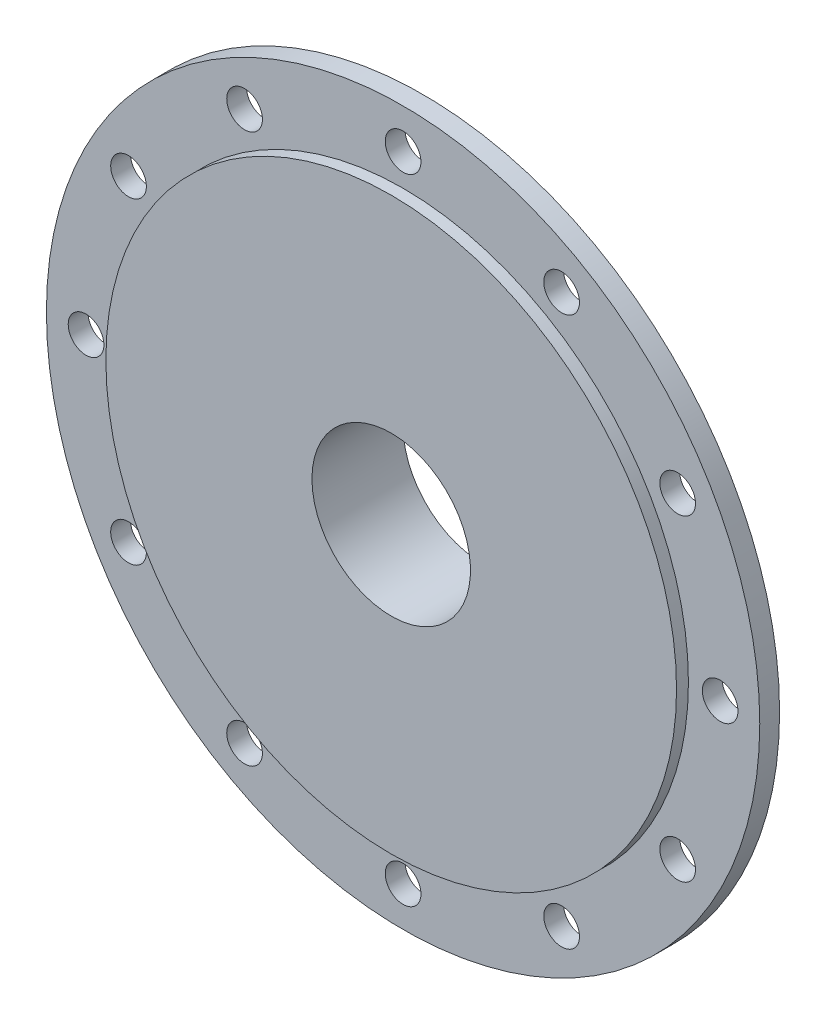
ISO-10303-21;
HEADER;
FILE_DESCRIPTION(('STEP AP214'),'2;1');
FILE_NAME('part.step','',(''),(''),'','','');
FILE_SCHEMA(('AUTOMOTIVE_DESIGN { 1 0 10303 214 1 1 1 1 }'));
ENDSEC;
DATA;
#1=APPLICATION_CONTEXT('core data for automotive mechanical design processes');
#2=APPLICATION_PROTOCOL_DEFINITION('international standard','automotive_design',2000,#1);
#3=PRODUCT_CONTEXT('',#1,'mechanical');
#4=PRODUCT('Part','Part','',(#3));
#5=PRODUCT_RELATED_PRODUCT_CATEGORY('part','',(#4));
#6=PRODUCT_DEFINITION_FORMATION('','',#4);
#7=PRODUCT_DEFINITION_CONTEXT('part definition',#1,'design');
#8=PRODUCT_DEFINITION('design','',#6,#7);
#9=PRODUCT_DEFINITION_SHAPE('','',#8);
#10=(LENGTH_UNIT() NAMED_UNIT(*) SI_UNIT(.MILLI.,.METRE.));
#11=(NAMED_UNIT(*) PLANE_ANGLE_UNIT() SI_UNIT($,.RADIAN.));
#12=(NAMED_UNIT(*) SI_UNIT($,.STERADIAN.) SOLID_ANGLE_UNIT());
#13=UNCERTAINTY_MEASURE_WITH_UNIT(LENGTH_MEASURE(1.E-05),#10,'distance_accuracy_value','');
#14=(GEOMETRIC_REPRESENTATION_CONTEXT(3) GLOBAL_UNCERTAINTY_ASSIGNED_CONTEXT((#13)) GLOBAL_UNIT_ASSIGNED_CONTEXT((#10,
#11,#12)) REPRESENTATION_CONTEXT('',''));
#15=CARTESIAN_POINT('',(0.,0.,0.));
#16=DIRECTION('',(0.,0.,1.));
#17=DIRECTION('',(1.,0.,0.));
#18=AXIS2_PLACEMENT_3D('',#15,#16,#17);
#19=CARTESIAN_POINT('',(0.,0.,0.));
#20=DIRECTION('',(0.,0.,-1.));
#21=DIRECTION('',(-1.,0.,0.));
#22=AXIS2_PLACEMENT_3D('',#19,#20,#21);
#23=CYLINDRICAL_SURFACE('',#22,67.5);
#24=CARTESIAN_POINT('',(0.,0.,-5.00000000000001));
#25=DIRECTION('',(0.,0.,-1.));
#26=DIRECTION('',(-1.,0.,0.));
#27=AXIS2_PLACEMENT_3D('',#24,#25,#26);
#28=CIRCLE('',#27,67.5);
#29=CARTESIAN_POINT('',(67.4536878161602,-2.5,-5.00000000000001));
#30=VERTEX_POINT('',#29);
#31=CARTESIAN_POINT('',(2.5,-67.4536878161602,-5.00000000000001));
#32=VERTEX_POINT('',#31);
#33=EDGE_CURVE('E368',#30,#32,#28,.T.);
#34=ORIENTED_EDGE('',*,*,#33,.F.);
#35=DIRECTION('',(0.,0.,-1.));
#36=VECTOR('',#35,1.);
#37=CARTESIAN_POINT('',(67.4536878161602,-2.5,0.));
#38=LINE('',#37,#36);
#39=CARTESIAN_POINT('',(67.4536878161602,-2.5,-8.00000000000001));
#40=VERTEX_POINT('',#39);
#41=EDGE_CURVE('E456',#30,#40,#38,.T.);
#42=ORIENTED_EDGE('',*,*,#41,.T.);
#43=CARTESIAN_POINT('',(0.,0.,-8.00000000000001));
#44=DIRECTION('',(0.,0.,-1.));
#45=DIRECTION('',(-1.,0.,0.));
#46=AXIS2_PLACEMENT_3D('',#43,#44,#45);
#47=CIRCLE('',#46,67.5);
#48=CARTESIAN_POINT('',(2.5,-67.4536878161602,-8.00000000000001));
#49=VERTEX_POINT('',#48);
#50=EDGE_CURVE('E375',#40,#49,#47,.T.);
#51=ORIENTED_EDGE('',*,*,#50,.T.);
#52=DIRECTION('',(0.,0.,-1.));
#53=VECTOR('',#52,1.);
#54=CARTESIAN_POINT('',(2.5,-67.4536878161602,0.));
#55=LINE('',#54,#53);
#56=EDGE_CURVE('E285',#32,#49,#55,.T.);
#57=ORIENTED_EDGE('',*,*,#56,.F.);
#58=EDGE_LOOP('',(#34,#42,#51,#57));
#59=FACE_BOUND('',#58,.T.);
#60=ADVANCED_FACE('F43',(#59),#23,.F.);
#61=CARTESIAN_POINT('',(0.,67.5,-5.00000000000001));
#62=DIRECTION('',(0.,0.,-1.));
#63=DIRECTION('',(-1.,0.,0.));
#64=AXIS2_PLACEMENT_3D('',#61,#62,#63);
#65=PLANE('',#64);
#66=CARTESIAN_POINT('',(0.,0.,-5.00000000000001));
#67=DIRECTION('',(0.,0.,-1.));
#68=DIRECTION('',(-1.,0.,0.));
#69=AXIS2_PLACEMENT_3D('',#66,#67,#68);
#70=CIRCLE('',#69,25.);
#71=CARTESIAN_POINT('',(24.8746859276655,-2.5,-5.00000000000001));
#72=VERTEX_POINT('',#71);
#73=CARTESIAN_POINT('',(2.5,-24.8746859276655,-5.00000000000001));
#74=VERTEX_POINT('',#73);
#75=EDGE_CURVE('E361',#72,#74,#70,.T.);
#76=ORIENTED_EDGE('',*,*,#75,.F.);
#77=DIRECTION('',(1.,0.,0.));
#78=VECTOR('',#77,1.);
#79=CARTESIAN_POINT('',(0.,-2.5,-5.00000000000001));
#80=LINE('',#79,#78);
#81=EDGE_CURVE('E59',#72,#30,#80,.T.);
#82=ORIENTED_EDGE('',*,*,#81,.T.);
#83=ORIENTED_EDGE('',*,*,#33,.T.);
#84=DIRECTION('',(0.,-1.,0.));
#85=VECTOR('',#84,1.);
#86=CARTESIAN_POINT('',(2.5,67.5,-5.00000000000001));
#87=LINE('',#86,#85);
#88=EDGE_CURVE('E289',#74,#32,#87,.T.);
#89=ORIENTED_EDGE('',*,*,#88,.F.);
#90=EDGE_LOOP('',(#76,#82,#83,#89));
#91=FACE_BOUND('',#90,.T.);
#92=ADVANCED_FACE('F403',(#91),#65,.T.);
#93=CARTESIAN_POINT('',(-2.5,-67.4536878161602,-8.00000000000001));
#94=VERTEX_POINT('',#93);
#95=CARTESIAN_POINT('',(-67.4536878161602,-2.5,-8.00000000000001));
#96=VERTEX_POINT('',#95);
#97=EDGE_CURVE('E376',#94,#96,#47,.T.);
#98=ORIENTED_EDGE('',*,*,#97,.T.);
#99=DIRECTION('',(0.,0.,-1.));
#100=VECTOR('',#99,1.);
#101=CARTESIAN_POINT('',(-67.4536878161602,-2.5,0.));
#102=LINE('',#101,#100);
#103=CARTESIAN_POINT('',(-67.4536878161602,-2.5,-5.00000000000001));
#104=VERTEX_POINT('',#103);
#105=EDGE_CURVE('E228',#96,#104,#102,.F.);
#106=ORIENTED_EDGE('',*,*,#105,.T.);
#107=CARTESIAN_POINT('',(-2.5,-67.4536878161602,-5.00000000000001));
#108=VERTEX_POINT('',#107);
#109=EDGE_CURVE('E369',#108,#104,#28,.T.);
#110=ORIENTED_EDGE('',*,*,#109,.F.);
#111=DIRECTION('',(0.,0.,-1.));
#112=VECTOR('',#111,1.);
#113=CARTESIAN_POINT('',(-2.5,-67.4536878161602,0.));
#114=LINE('',#113,#112);
#115=EDGE_CURVE('E270',#108,#94,#114,.T.);
#116=ORIENTED_EDGE('',*,*,#115,.T.);
#117=EDGE_LOOP('',(#98,#106,#110,#116));
#118=FACE_BOUND('',#117,.T.);
#119=ADVANCED_FACE('F406',(#118),#23,.F.);
#120=ORIENTED_EDGE('',*,*,#109,.T.);
#121=DIRECTION('',(1.,0.,0.));
#122=VECTOR('',#121,1.);
#123=CARTESIAN_POINT('',(0.,-2.5,-5.00000000000001));
#124=LINE('',#123,#122);
#125=CARTESIAN_POINT('',(-24.8746859276655,-2.5,-5.00000000000001));
#126=VERTEX_POINT('',#125);
#127=EDGE_CURVE('E232',#104,#126,#124,.T.);
#128=ORIENTED_EDGE('',*,*,#127,.T.);
#129=CARTESIAN_POINT('',(-2.5,-24.8746859276655,-5.00000000000001));
#130=VERTEX_POINT('',#129);
#131=EDGE_CURVE('E362',#130,#126,#70,.T.);
#132=ORIENTED_EDGE('',*,*,#131,.F.);
#133=DIRECTION('',(0.,-1.,0.));
#134=VECTOR('',#133,1.);
#135=CARTESIAN_POINT('',(-2.5,67.5,-5.00000000000001));
#136=LINE('',#135,#134);
#137=EDGE_CURVE('E274',#130,#108,#136,.T.);
#138=ORIENTED_EDGE('',*,*,#137,.T.);
#139=EDGE_LOOP('',(#120,#128,#132,#138));
#140=FACE_BOUND('',#139,.T.);
#141=ADVANCED_FACE('F413',(#140),#65,.T.);
#142=DIRECTION('',(0.,0.,-1.));
#143=VECTOR('',#142,1.);
#144=CARTESIAN_POINT('',(-67.4536878161602,2.5,0.));
#145=LINE('',#144,#143);
#146=CARTESIAN_POINT('',(-67.4536878161602,2.5,-8.00000000000001));
#147=VERTEX_POINT('',#146);
#148=CARTESIAN_POINT('',(-67.4536878161602,2.5,-5.00000000000001));
#149=VERTEX_POINT('',#148);
#150=EDGE_CURVE('E243',#147,#149,#145,.F.);
#151=ORIENTED_EDGE('',*,*,#150,.F.);
#152=CARTESIAN_POINT('',(-2.5,67.4536878161602,-8.00000000000001));
#153=VERTEX_POINT('',#152);
#154=EDGE_CURVE('E367',#147,#153,#47,.T.);
#155=ORIENTED_EDGE('',*,*,#154,.T.);
#156=DIRECTION('',(0.,0.,-1.));
#157=VECTOR('',#156,1.);
#158=CARTESIAN_POINT('',(-2.5,67.4536878161602,0.));
#159=LINE('',#158,#157);
#160=CARTESIAN_POINT('',(-2.5,67.4536878161602,-5.00000000000001));
#161=VERTEX_POINT('',#160);
#162=EDGE_CURVE('E314',#153,#161,#159,.F.);
#163=ORIENTED_EDGE('',*,*,#162,.T.);
#164=EDGE_CURVE('E360',#149,#161,#28,.T.);
#165=ORIENTED_EDGE('',*,*,#164,.F.);
#166=EDGE_LOOP('',(#151,#155,#163,#165));
#167=FACE_BOUND('',#166,.T.);
#168=ADVANCED_FACE('F419',(#167),#23,.F.);
#169=DIRECTION('',(1.,0.,0.));
#170=VECTOR('',#169,1.);
#171=CARTESIAN_POINT('',(0.,2.5,-5.00000000000001));
#172=LINE('',#171,#170);
#173=CARTESIAN_POINT('',(-24.8746859276655,2.5,-5.00000000000001));
#174=VERTEX_POINT('',#173);
#175=EDGE_CURVE('E246',#149,#174,#172,.T.);
#176=ORIENTED_EDGE('',*,*,#175,.F.);
#177=ORIENTED_EDGE('',*,*,#164,.T.);
#178=DIRECTION('',(0.,-1.,0.));
#179=VECTOR('',#178,1.);
#180=CARTESIAN_POINT('',(-2.5,67.5,-5.00000000000001));
#181=LINE('',#180,#179);
#182=CARTESIAN_POINT('',(-2.5,24.8746859276655,-5.00000000000001));
#183=VERTEX_POINT('',#182);
#184=EDGE_CURVE('E310',#161,#183,#181,.T.);
#185=ORIENTED_EDGE('',*,*,#184,.T.);
#186=EDGE_CURVE('E356',#174,#183,#70,.T.);
#187=ORIENTED_EDGE('',*,*,#186,.F.);
#188=EDGE_LOOP('',(#176,#177,#185,#187));
#189=FACE_BOUND('',#188,.T.);
#190=ADVANCED_FACE('F400',(#189),#65,.T.);
#191=CARTESIAN_POINT('',(0.,20.,0.));
#192=DIRECTION('',(0.,0.,1.));
#193=DIRECTION('',(1.,0.,0.));
#194=AXIS2_PLACEMENT_3D('',#191,#192,#193);
#195=PLANE('',#194);
#196=CARTESIAN_POINT('',(0.,0.,0.));
#197=DIRECTION('',(0.,0.,-1.));
#198=DIRECTION('',(-1.,0.,0.));
#199=AXIS2_PLACEMENT_3D('',#196,#197,#198);
#200=CIRCLE('',#199,20.);
#201=CARTESIAN_POINT('',(-20.,0.,0.));
#202=VERTEX_POINT('',#201);
#203=EDGE_CURVE('E345',#202,#202,#200,.T.);
#204=ORIENTED_EDGE('',*,*,#203,.T.);
#205=EDGE_LOOP('',(#204));
#206=FACE_BOUND('',#205,.T.);
#207=CARTESIAN_POINT('',(0.,0.,0.));
#208=DIRECTION('',(0.,0.,-1.));
#209=DIRECTION('',(-1.,0.,0.));
#210=AXIS2_PLACEMENT_3D('',#207,#208,#209);
#211=CIRCLE('',#210,72.);
#212=CARTESIAN_POINT('',(-72.,0.,0.));
#213=VERTEX_POINT('',#212);
#214=EDGE_CURVE('E11',#213,#213,#211,.T.);
#215=ORIENTED_EDGE('',*,*,#214,.F.);
#216=EDGE_LOOP('',(#215));
#217=FACE_BOUND('',#216,.T.);
#218=ADVANCED_FACE('F45',(#206,#217),#195,.T.);
#219=CARTESIAN_POINT('',(0.,0.,0.));
#220=DIRECTION('',(0.,0.,-1.));
#221=DIRECTION('',(-1.,0.,0.));
#222=AXIS2_PLACEMENT_3D('',#219,#220,#221);
#223=CYLINDRICAL_SURFACE('',#222,72.);
#224=ORIENTED_EDGE('',*,*,#214,.T.);
#225=EDGE_LOOP('',(#224));
#226=FACE_BOUND('',#225,.T.);
#227=CARTESIAN_POINT('',(0.,0.,-3.));
#228=DIRECTION('',(0.,0.,-1.));
#229=DIRECTION('',(-1.,0.,0.));
#230=AXIS2_PLACEMENT_3D('',#227,#228,#229);
#231=CIRCLE('',#230,72.);
#232=CARTESIAN_POINT('',(-72.,0.,-3.));
#233=VERTEX_POINT('',#232);
#234=EDGE_CURVE('E52',#233,#233,#231,.T.);
#235=ORIENTED_EDGE('',*,*,#234,.F.);
#236=EDGE_LOOP('',(#235));
#237=FACE_BOUND('',#236,.T.);
#238=ADVANCED_FACE('F390',(#226,#237),#223,.T.);
#239=CARTESIAN_POINT('',(0.,72.,-3.));
#240=DIRECTION('',(0.,0.,1.));
#241=DIRECTION('',(1.,0.,0.));
#242=AXIS2_PLACEMENT_3D('',#239,#240,#241);
#243=PLANE('',#242);
#244=CARTESIAN_POINT('',(0.,80.,-3.));
#245=DIRECTION('',(0.,0.,1.));
#246=DIRECTION('',(1.,0.,0.));
#247=AXIS2_PLACEMENT_3D('',#244,#245,#246);
#248=CIRCLE('',#247,4.5);
#249=CARTESIAN_POINT('',(4.5,80.,-3.));
#250=VERTEX_POINT('',#249);
#251=EDGE_CURVE('E929',#250,#250,#248,.F.);
#252=ORIENTED_EDGE('',*,*,#251,.T.);
#253=EDGE_LOOP('',(#252));
#254=FACE_BOUND('',#253,.T.);
#255=CARTESIAN_POINT('',(39.9999999999996,69.2820323027534,-3.));
#256=DIRECTION('',(0.,0.,1.));
#257=DIRECTION('',(1.,0.,0.));
#258=AXIS2_PLACEMENT_3D('',#255,#256,#257);
#259=CIRCLE('',#258,4.50000000000195);
#260=CARTESIAN_POINT('',(44.5000000000015,69.2820323027534,-3.));
#261=VERTEX_POINT('',#260);
#262=EDGE_CURVE('E955',#261,#261,#259,.F.);
#263=ORIENTED_EDGE('',*,*,#262,.T.);
#264=EDGE_LOOP('',(#263));
#265=FACE_BOUND('',#264,.T.);
#266=CARTESIAN_POINT('',(69.2820323027551,39.9999999999999,-3.));
#267=DIRECTION('',(0.,0.,1.));
#268=DIRECTION('',(1.,0.,0.));
#269=AXIS2_PLACEMENT_3D('',#266,#267,#268);
#270=CIRCLE('',#269,4.50000000000096);
#271=CARTESIAN_POINT('',(73.7820323027561,39.9999999999999,-3.));
#272=VERTEX_POINT('',#271);
#273=EDGE_CURVE('E947',#272,#272,#270,.F.);
#274=ORIENTED_EDGE('',*,*,#273,.T.);
#275=EDGE_LOOP('',(#274));
#276=FACE_BOUND('',#275,.T.);
#277=CARTESIAN_POINT('',(80.,0.,-3.));
#278=DIRECTION('',(0.,0.,1.));
#279=DIRECTION('',(1.,0.,0.));
#280=AXIS2_PLACEMENT_3D('',#277,#278,#279);
#281=CIRCLE('',#280,4.50000000000081);
#282=CARTESIAN_POINT('',(84.5000000000008,0.,-3.));
#283=VERTEX_POINT('',#282);
#284=EDGE_CURVE('E938',#283,#283,#281,.F.);
#285=ORIENTED_EDGE('',*,*,#284,.T.);
#286=EDGE_LOOP('',(#285));
#287=FACE_BOUND('',#286,.T.);
#288=CARTESIAN_POINT('',(-40.0000000000001,69.2820323027551,-3.));
#289=DIRECTION('',(0.,0.,1.));
#290=DIRECTION('',(1.,0.,0.));
#291=AXIS2_PLACEMENT_3D('',#288,#289,#290);
#292=CIRCLE('',#291,4.5);
#293=CARTESIAN_POINT('',(-35.5000000000001,69.2820323027551,-3.));
#294=VERTEX_POINT('',#293);
#295=EDGE_CURVE('E935',#294,#294,#292,.F.);
#296=ORIENTED_EDGE('',*,*,#295,.T.);
#297=EDGE_LOOP('',(#296));
#298=FACE_BOUND('',#297,.T.);
#299=CARTESIAN_POINT('',(-69.2820323027551,40.,-3.));
#300=DIRECTION('',(0.,0.,1.));
#301=DIRECTION('',(1.,0.,0.));
#302=AXIS2_PLACEMENT_3D('',#299,#300,#301);
#303=CIRCLE('',#302,4.50000000000018);
#304=CARTESIAN_POINT('',(-64.7820323027549,40.,-3.));
#305=VERTEX_POINT('',#304);
#306=EDGE_CURVE('E1002',#305,#305,#303,.F.);
#307=ORIENTED_EDGE('',*,*,#306,.T.);
#308=EDGE_LOOP('',(#307));
#309=FACE_BOUND('',#308,.T.);
#310=CARTESIAN_POINT('',(-80.,0.,-3.));
#311=DIRECTION('',(0.,0.,1.));
#312=DIRECTION('',(1.,0.,0.));
#313=AXIS2_PLACEMENT_3D('',#310,#311,#312);
#314=CIRCLE('',#313,4.50000000000027);
#315=CARTESIAN_POINT('',(-75.4999999999997,0.,-3.));
#316=VERTEX_POINT('',#315);
#317=EDGE_CURVE('E1010',#316,#316,#314,.F.);
#318=ORIENTED_EDGE('',*,*,#317,.T.);
#319=EDGE_LOOP('',(#318));
#320=FACE_BOUND('',#319,.T.);
#321=CARTESIAN_POINT('',(-69.2820323027551,-40.,-3.));
#322=DIRECTION('',(0.,0.,1.));
#323=DIRECTION('',(1.,0.,0.));
#324=AXIS2_PLACEMENT_3D('',#321,#322,#323);
#325=CIRCLE('',#324,4.50000000000037);
#326=CARTESIAN_POINT('',(-64.7820323027547,-40.,-3.));
#327=VERTEX_POINT('',#326);
#328=EDGE_CURVE('E1018',#327,#327,#325,.F.);
#329=ORIENTED_EDGE('',*,*,#328,.T.);
#330=EDGE_LOOP('',(#329));
#331=FACE_BOUND('',#330,.T.);
#332=CARTESIAN_POINT('',(-40.,-69.2820323027551,-3.));
#333=DIRECTION('',(0.,0.,1.));
#334=DIRECTION('',(1.,0.,0.));
#335=AXIS2_PLACEMENT_3D('',#332,#333,#334);
#336=CIRCLE('',#335,4.50000000000049);
#337=CARTESIAN_POINT('',(-35.4999999999995,-69.2820323027551,-3.));
#338=VERTEX_POINT('',#337);
#339=EDGE_CURVE('E963',#338,#338,#336,.F.);
#340=ORIENTED_EDGE('',*,*,#339,.T.);
#341=EDGE_LOOP('',(#340));
#342=FACE_BOUND('',#341,.T.);
#343=CARTESIAN_POINT('',(0.,-80.,-3.));
#344=DIRECTION('',(0.,0.,1.));
#345=DIRECTION('',(1.,0.,0.));
#346=AXIS2_PLACEMENT_3D('',#343,#344,#345);
#347=CIRCLE('',#346,4.50000000000054);
#348=CARTESIAN_POINT('',(4.50000000000054,-80.,-3.));
#349=VERTEX_POINT('',#348);
#350=EDGE_CURVE('E972',#349,#349,#347,.F.);
#351=ORIENTED_EDGE('',*,*,#350,.T.);
#352=EDGE_LOOP('',(#351));
#353=FACE_BOUND('',#352,.T.);
#354=CARTESIAN_POINT('',(40.,-69.2820323027551,-3.));
#355=DIRECTION('',(0.,0.,1.));
#356=DIRECTION('',(1.,0.,0.));
#357=AXIS2_PLACEMENT_3D('',#354,#355,#356);
#358=CIRCLE('',#357,4.50000000000065);
#359=CARTESIAN_POINT('',(44.5000000000006,-69.2820323027551,-3.));
#360=VERTEX_POINT('',#359);
#361=EDGE_CURVE('E980',#360,#360,#358,.F.);
#362=ORIENTED_EDGE('',*,*,#361,.T.);
#363=EDGE_LOOP('',(#362));
#364=FACE_BOUND('',#363,.T.);
#365=CARTESIAN_POINT('',(69.2820323027551,-40.,-3.));
#366=DIRECTION('',(0.,0.,1.));
#367=DIRECTION('',(1.,0.,0.));
#368=AXIS2_PLACEMENT_3D('',#365,#366,#367);
#369=CIRCLE('',#368,4.50000000000072);
#370=CARTESIAN_POINT('',(73.7820323027558,-40.,-3.));
#371=VERTEX_POINT('',#370);
#372=EDGE_CURVE('E988',#371,#371,#369,.F.);
#373=ORIENTED_EDGE('',*,*,#372,.T.);
#374=EDGE_LOOP('',(#373));
#375=FACE_BOUND('',#374,.T.);
#376=ORIENTED_EDGE('',*,*,#234,.T.);
#377=EDGE_LOOP('',(#376));
#378=FACE_BOUND('',#377,.T.);
#379=CARTESIAN_POINT('',(0.,0.,-3.));
#380=DIRECTION('',(0.,0.,-1.));
#381=DIRECTION('',(-1.,0.,0.));
#382=AXIS2_PLACEMENT_3D('',#379,#380,#381);
#383=CIRCLE('',#382,90.);
#384=CARTESIAN_POINT('',(-90.,0.,-3.));
#385=VERTEX_POINT('',#384);
#386=EDGE_CURVE('E380',#385,#385,#383,.T.);
#387=ORIENTED_EDGE('',*,*,#386,.F.);
#388=EDGE_LOOP('',(#387));
#389=FACE_BOUND('',#388,.T.);
#390=ADVANCED_FACE('F387',(#254,#265,#276,#287,#298,#309,#320,#331,#342,#353,#364,#375,#378,
#389),#243,.T.);
#391=CARTESIAN_POINT('',(0.,0.,0.));
#392=DIRECTION('',(0.,0.,-1.));
#393=DIRECTION('',(-1.,0.,0.));
#394=AXIS2_PLACEMENT_3D('',#391,#392,#393);
#395=CYLINDRICAL_SURFACE('',#394,90.);
#396=CARTESIAN_POINT('',(0.,0.,-8.));
#397=DIRECTION('',(0.,0.,-1.));
#398=DIRECTION('',(-1.,0.,0.));
#399=AXIS2_PLACEMENT_3D('',#396,#397,#398);
#400=CIRCLE('',#399,90.);
#401=CARTESIAN_POINT('',(-90.,0.,-8.));
#402=VERTEX_POINT('',#401);
#403=EDGE_CURVE('E374',#402,#402,#400,.T.);
#404=ORIENTED_EDGE('',*,*,#403,.F.);
#405=EDGE_LOOP('',(#404));
#406=FACE_BOUND('',#405,.T.);
#407=ORIENTED_EDGE('',*,*,#386,.T.);
#408=EDGE_LOOP('',(#407));
#409=FACE_BOUND('',#408,.T.);
#410=ADVANCED_FACE('F397',(#406,#409),#395,.T.);
#411=CARTESIAN_POINT('',(0.,90.,-8.));
#412=DIRECTION('',(0.,0.,-1.));
#413=DIRECTION('',(-1.,0.,0.));
#414=AXIS2_PLACEMENT_3D('',#411,#412,#413);
#415=PLANE('',#414);
#416=CARTESIAN_POINT('',(0.,80.,-8.));
#417=DIRECTION('',(0.,0.,-1.));
#418=DIRECTION('',(-1.,0.,0.));
#419=AXIS2_PLACEMENT_3D('',#416,#417,#418);
#420=CIRCLE('',#419,4.5);
#421=CARTESIAN_POINT('',(-4.5,80.,-8.));
#422=VERTEX_POINT('',#421);
#423=EDGE_CURVE('E198',#422,#422,#420,.T.);
#424=ORIENTED_EDGE('',*,*,#423,.F.);
#425=EDGE_LOOP('',(#424));
#426=FACE_BOUND('',#425,.T.);
#427=CARTESIAN_POINT('',(39.9999999999996,69.2820323027534,-8.));
#428=DIRECTION('',(0.,0.,-1.));
#429=DIRECTION('',(-1.,0.,0.));
#430=AXIS2_PLACEMENT_3D('',#427,#428,#429);
#431=CIRCLE('',#430,4.50000000000195);
#432=CARTESIAN_POINT('',(35.4999999999976,69.2820323027534,-8.));
#433=VERTEX_POINT('',#432);
#434=EDGE_CURVE('E959',#433,#433,#431,.T.);
#435=ORIENTED_EDGE('',*,*,#434,.F.);
#436=EDGE_LOOP('',(#435));
#437=FACE_BOUND('',#436,.T.);
#438=CARTESIAN_POINT('',(69.2820323027551,39.9999999999999,-8.));
#439=DIRECTION('',(0.,0.,-1.));
#440=DIRECTION('',(-1.,0.,0.));
#441=AXIS2_PLACEMENT_3D('',#438,#439,#440);
#442=CIRCLE('',#441,4.50000000000096);
#443=CARTESIAN_POINT('',(64.7820323027542,39.9999999999999,-8.));
#444=VERTEX_POINT('',#443);
#445=EDGE_CURVE('E951',#444,#444,#442,.T.);
#446=ORIENTED_EDGE('',*,*,#445,.F.);
#447=EDGE_LOOP('',(#446));
#448=FACE_BOUND('',#447,.T.);
#449=CARTESIAN_POINT('',(80.,0.,-8.));
#450=DIRECTION('',(0.,0.,-1.));
#451=DIRECTION('',(-1.,0.,0.));
#452=AXIS2_PLACEMENT_3D('',#449,#450,#451);
#453=CIRCLE('',#452,4.50000000000081);
#454=CARTESIAN_POINT('',(75.4999999999992,0.,-8.));
#455=VERTEX_POINT('',#454);
#456=EDGE_CURVE('E943',#455,#455,#453,.T.);
#457=ORIENTED_EDGE('',*,*,#456,.F.);
#458=EDGE_LOOP('',(#457));
#459=FACE_BOUND('',#458,.T.);
#460=CARTESIAN_POINT('',(-40.0000000000001,69.2820323027551,-8.));
#461=DIRECTION('',(0.,0.,-1.));
#462=DIRECTION('',(-1.,0.,0.));
#463=AXIS2_PLACEMENT_3D('',#460,#461,#462);
#464=CIRCLE('',#463,4.5);
#465=CARTESIAN_POINT('',(-44.5000000000001,69.2820323027551,-8.));
#466=VERTEX_POINT('',#465);
#467=EDGE_CURVE('E998',#466,#466,#464,.T.);
#468=ORIENTED_EDGE('',*,*,#467,.F.);
#469=EDGE_LOOP('',(#468));
#470=FACE_BOUND('',#469,.T.);
#471=CARTESIAN_POINT('',(-69.2820323027551,40.,-8.));
#472=DIRECTION('',(0.,0.,-1.));
#473=DIRECTION('',(-1.,0.,0.));
#474=AXIS2_PLACEMENT_3D('',#471,#472,#473);
#475=CIRCLE('',#474,4.50000000000018);
#476=CARTESIAN_POINT('',(-73.7820323027553,40.,-8.));
#477=VERTEX_POINT('',#476);
#478=EDGE_CURVE('E1006',#477,#477,#475,.T.);
#479=ORIENTED_EDGE('',*,*,#478,.F.);
#480=EDGE_LOOP('',(#479));
#481=FACE_BOUND('',#480,.T.);
#482=CARTESIAN_POINT('',(-80.,0.,-8.));
#483=DIRECTION('',(0.,0.,-1.));
#484=DIRECTION('',(-1.,0.,0.));
#485=AXIS2_PLACEMENT_3D('',#482,#483,#484);
#486=CIRCLE('',#485,4.50000000000027);
#487=CARTESIAN_POINT('',(-84.5000000000003,0.,-8.));
#488=VERTEX_POINT('',#487);
#489=EDGE_CURVE('E1014',#488,#488,#486,.T.);
#490=ORIENTED_EDGE('',*,*,#489,.F.);
#491=EDGE_LOOP('',(#490));
#492=FACE_BOUND('',#491,.T.);
#493=CARTESIAN_POINT('',(-69.2820323027551,-40.,-8.));
#494=DIRECTION('',(0.,0.,-1.));
#495=DIRECTION('',(-1.,0.,0.));
#496=AXIS2_PLACEMENT_3D('',#493,#494,#495);
#497=CIRCLE('',#496,4.50000000000037);
#498=CARTESIAN_POINT('',(-73.7820323027555,-40.,-8.));
#499=VERTEX_POINT('',#498);
#500=EDGE_CURVE('E967',#499,#499,#497,.T.);
#501=ORIENTED_EDGE('',*,*,#500,.F.);
#502=EDGE_LOOP('',(#501));
#503=FACE_BOUND('',#502,.T.);
#504=CARTESIAN_POINT('',(-40.,-69.2820323027551,-8.));
#505=DIRECTION('',(0.,0.,-1.));
#506=DIRECTION('',(-1.,0.,0.));
#507=AXIS2_PLACEMENT_3D('',#504,#505,#506);
#508=CIRCLE('',#507,4.50000000000049);
#509=CARTESIAN_POINT('',(-44.5000000000005,-69.2820323027551,-8.));
#510=VERTEX_POINT('',#509);
#511=EDGE_CURVE('E968',#510,#510,#508,.T.);
#512=ORIENTED_EDGE('',*,*,#511,.F.);
#513=EDGE_LOOP('',(#512));
#514=FACE_BOUND('',#513,.T.);
#515=CARTESIAN_POINT('',(0.,-80.,-8.));
#516=DIRECTION('',(0.,0.,-1.));
#517=DIRECTION('',(-1.,0.,0.));
#518=AXIS2_PLACEMENT_3D('',#515,#516,#517);
#519=CIRCLE('',#518,4.50000000000054);
#520=CARTESIAN_POINT('',(-4.50000000000054,-80.,-8.));
#521=VERTEX_POINT('',#520);
#522=EDGE_CURVE('E976',#521,#521,#519,.T.);
#523=ORIENTED_EDGE('',*,*,#522,.F.);
#524=EDGE_LOOP('',(#523));
#525=FACE_BOUND('',#524,.T.);
#526=CARTESIAN_POINT('',(40.,-69.2820323027551,-8.));
#527=DIRECTION('',(0.,0.,-1.));
#528=DIRECTION('',(-1.,0.,0.));
#529=AXIS2_PLACEMENT_3D('',#526,#527,#528);
#530=CIRCLE('',#529,4.50000000000065);
#531=CARTESIAN_POINT('',(35.4999999999993,-69.2820323027551,-8.));
#532=VERTEX_POINT('',#531);
#533=EDGE_CURVE('E984',#532,#532,#530,.T.);
#534=ORIENTED_EDGE('',*,*,#533,.F.);
#535=EDGE_LOOP('',(#534));
#536=FACE_BOUND('',#535,.T.);
#537=CARTESIAN_POINT('',(69.2820323027551,-40.,-8.));
#538=DIRECTION('',(0.,0.,-1.));
#539=DIRECTION('',(-1.,0.,0.));
#540=AXIS2_PLACEMENT_3D('',#537,#538,#539);
#541=CIRCLE('',#540,4.50000000000072);
#542=CARTESIAN_POINT('',(64.7820323027544,-40.,-8.));
#543=VERTEX_POINT('',#542);
#544=EDGE_CURVE('E942',#543,#543,#541,.T.);
#545=ORIENTED_EDGE('',*,*,#544,.F.);
#546=EDGE_LOOP('',(#545));
#547=FACE_BOUND('',#546,.T.);
#548=DIRECTION('',(1.,0.,0.));
#549=VECTOR('',#548,1.);
#550=CARTESIAN_POINT('',(0.,2.5,-8.));
#551=LINE('',#550,#549);
#552=CARTESIAN_POINT('',(-67.5,2.5,-8.));
#553=VERTEX_POINT('',#552);
#554=EDGE_CURVE('E239',#553,#147,#551,.T.);
#555=ORIENTED_EDGE('',*,*,#554,.F.);
#556=DIRECTION('',(0.,1.,0.));
#557=VECTOR('',#556,1.);
#558=CARTESIAN_POINT('',(-67.5,90.,-8.));
#559=LINE('',#558,#557);
#560=CARTESIAN_POINT('',(-67.5,-2.5,-8.));
#561=VERTEX_POINT('',#560);
#562=EDGE_CURVE('E253',#561,#553,#559,.T.);
#563=ORIENTED_EDGE('',*,*,#562,.F.);
#564=DIRECTION('',(1.,0.,0.));
#565=VECTOR('',#564,1.);
#566=CARTESIAN_POINT('',(0.,-2.5,-8.));
#567=LINE('',#566,#565);
#568=EDGE_CURVE('E223',#561,#96,#567,.T.);
#569=ORIENTED_EDGE('',*,*,#568,.T.);
#570=ORIENTED_EDGE('',*,*,#97,.F.);
#571=DIRECTION('',(0.,-1.,0.));
#572=VECTOR('',#571,1.);
#573=CARTESIAN_POINT('',(-2.5,90.,-8.));
#574=LINE('',#573,#572);
#575=CARTESIAN_POINT('',(-2.5,-67.5000000000001,-7.99999999999999));
#576=VERTEX_POINT('',#575);
#577=EDGE_CURVE('E265',#94,#576,#574,.T.);
#578=ORIENTED_EDGE('',*,*,#577,.T.);
#579=DIRECTION('',(1.,0.,0.));
#580=VECTOR('',#579,1.);
#581=CARTESIAN_POINT('',(0.,-67.5,-8.));
#582=LINE('',#581,#580);
#583=CARTESIAN_POINT('',(2.5,-67.5000000000001,-7.99999999999999));
#584=VERTEX_POINT('',#583);
#585=EDGE_CURVE('E298',#584,#576,#582,.F.);
#586=ORIENTED_EDGE('',*,*,#585,.F.);
#587=DIRECTION('',(0.,-1.,0.));
#588=VECTOR('',#587,1.);
#589=CARTESIAN_POINT('',(2.5,90.,-8.));
#590=LINE('',#589,#588);
#591=EDGE_CURVE('E281',#49,#584,#590,.T.);
#592=ORIENTED_EDGE('',*,*,#591,.F.);
#593=ORIENTED_EDGE('',*,*,#50,.F.);
#594=DIRECTION('',(1.,0.,0.));
#595=VECTOR('',#594,1.);
#596=CARTESIAN_POINT('',(0.,-2.5,-8.));
#597=LINE('',#596,#595);
#598=CARTESIAN_POINT('',(67.5,-2.5,-8.));
#599=VERTEX_POINT('',#598);
#600=EDGE_CURVE('E491',#40,#599,#597,.T.);
#601=ORIENTED_EDGE('',*,*,#600,.T.);
#602=DIRECTION('',(0.,1.,0.));
#603=VECTOR('',#602,1.);
#604=CARTESIAN_POINT('',(67.5,90.,-8.));
#605=LINE('',#604,#603);
#606=CARTESIAN_POINT('',(67.5,2.5,-8.));
#607=VERTEX_POINT('',#606);
#608=EDGE_CURVE('E196',#607,#599,#605,.F.);
#609=ORIENTED_EDGE('',*,*,#608,.F.);
#610=DIRECTION('',(1.,0.,0.));
#611=VECTOR('',#610,1.);
#612=CARTESIAN_POINT('',(0.,2.5,-8.));
#613=LINE('',#612,#611);
#614=CARTESIAN_POINT('',(67.4536878161602,2.5,-8.00000000000001));
#615=VERTEX_POINT('',#614);
#616=EDGE_CURVE('E206',#615,#607,#613,.T.);
#617=ORIENTED_EDGE('',*,*,#616,.F.);
#618=CARTESIAN_POINT('',(2.5,67.4536878161602,-8.00000000000001));
#619=VERTEX_POINT('',#618);
#620=EDGE_CURVE('E370',#619,#615,#47,.T.);
#621=ORIENTED_EDGE('',*,*,#620,.F.);
#622=DIRECTION('',(0.,-1.,0.));
#623=VECTOR('',#622,1.);
#624=CARTESIAN_POINT('',(2.5,90.,-8.));
#625=LINE('',#624,#623);
#626=CARTESIAN_POINT('',(2.5,67.4999999999999,-8.00000000000001));
#627=VERTEX_POINT('',#626);
#628=EDGE_CURVE('E330',#627,#619,#625,.T.);
#629=ORIENTED_EDGE('',*,*,#628,.F.);
#630=DIRECTION('',(1.,0.,0.));
#631=VECTOR('',#630,1.);
#632=CARTESIAN_POINT('',(0.,67.5,-8.));
#633=LINE('',#632,#631);
#634=CARTESIAN_POINT('',(-2.5,67.4999999999999,-8.00000000000001));
#635=VERTEX_POINT('',#634);
#636=EDGE_CURVE('E341',#635,#627,#633,.T.);
#637=ORIENTED_EDGE('',*,*,#636,.F.);
#638=DIRECTION('',(0.,-1.,0.));
#639=VECTOR('',#638,1.);
#640=CARTESIAN_POINT('',(-2.5,90.,-8.));
#641=LINE('',#640,#639);
#642=EDGE_CURVE('E315',#635,#153,#641,.T.);
#643=ORIENTED_EDGE('',*,*,#642,.T.);
#644=ORIENTED_EDGE('',*,*,#154,.F.);
#645=EDGE_LOOP('',(#555,#563,#569,#570,#578,#586,#592,#593,#601,#609,#617,#621,#629,#637,#643,#644));
#646=FACE_BOUND('',#645,.T.);
#647=ORIENTED_EDGE('',*,*,#403,.T.);
#648=EDGE_LOOP('',(#647));
#649=FACE_BOUND('',#648,.T.);
#650=ADVANCED_FACE('F421',(#426,#437,#448,#459,#470,#481,#492,#503,#514,#525,#536,#547,#646,
#649),#415,.T.);
#651=DIRECTION('',(0.,0.,-1.));
#652=VECTOR('',#651,1.);
#653=CARTESIAN_POINT('',(67.4536878161602,2.5,0.));
#654=LINE('',#653,#652);
#655=CARTESIAN_POINT('',(67.4536878161602,2.5,-5.00000000000001));
#656=VERTEX_POINT('',#655);
#657=EDGE_CURVE('E211',#656,#615,#654,.T.);
#658=ORIENTED_EDGE('',*,*,#657,.F.);
#659=CARTESIAN_POINT('',(2.5,67.4536878161602,-5.00000000000001));
#660=VERTEX_POINT('',#659);
#661=EDGE_CURVE('E363',#660,#656,#28,.T.);
#662=ORIENTED_EDGE('',*,*,#661,.F.);
#663=DIRECTION('',(0.,0.,-1.));
#664=VECTOR('',#663,1.);
#665=CARTESIAN_POINT('',(2.5,67.4536878161602,0.));
#666=LINE('',#665,#664);
#667=EDGE_CURVE('E329',#619,#660,#666,.F.);
#668=ORIENTED_EDGE('',*,*,#667,.F.);
#669=ORIENTED_EDGE('',*,*,#620,.T.);
#670=EDGE_LOOP('',(#658,#662,#668,#669));
#671=FACE_BOUND('',#670,.T.);
#672=ADVANCED_FACE('F407',(#671),#23,.F.);
#673=DIRECTION('',(1.,0.,0.));
#674=VECTOR('',#673,1.);
#675=CARTESIAN_POINT('',(0.,2.5,-5.00000000000001));
#676=LINE('',#675,#674);
#677=CARTESIAN_POINT('',(24.8746859276655,2.5,-5.00000000000001));
#678=VERTEX_POINT('',#677);
#679=EDGE_CURVE('E496',#678,#656,#676,.T.);
#680=ORIENTED_EDGE('',*,*,#679,.F.);
#681=CARTESIAN_POINT('',(2.5,24.8746859276655,-5.00000000000001));
#682=VERTEX_POINT('',#681);
#683=EDGE_CURVE('E357',#682,#678,#70,.T.);
#684=ORIENTED_EDGE('',*,*,#683,.F.);
#685=DIRECTION('',(0.,-1.,0.));
#686=VECTOR('',#685,1.);
#687=CARTESIAN_POINT('',(2.5,67.5,-5.00000000000001));
#688=LINE('',#687,#686);
#689=EDGE_CURVE('E326',#660,#682,#688,.T.);
#690=ORIENTED_EDGE('',*,*,#689,.F.);
#691=ORIENTED_EDGE('',*,*,#661,.T.);
#692=EDGE_LOOP('',(#680,#684,#690,#691));
#693=FACE_BOUND('',#692,.T.);
#694=ADVANCED_FACE('F414',(#693),#65,.T.);
#695=CARTESIAN_POINT('',(0.,0.,0.));
#696=DIRECTION('',(0.,0.,-1.));
#697=DIRECTION('',(-1.,0.,0.));
#698=AXIS2_PLACEMENT_3D('',#695,#696,#697);
#699=CYLINDRICAL_SURFACE('',#698,25.);
#700=CARTESIAN_POINT('',(0.,0.,-23.));
#701=DIRECTION('',(0.,0.,-1.));
#702=DIRECTION('',(-1.,0.,0.));
#703=AXIS2_PLACEMENT_3D('',#700,#701,#702);
#704=CIRCLE('',#703,25.);
#705=CARTESIAN_POINT('',(-25.,0.,-23.));
#706=VERTEX_POINT('',#705);
#707=EDGE_CURVE('E349',#706,#706,#704,.T.);
#708=ORIENTED_EDGE('',*,*,#707,.F.);
#709=EDGE_LOOP('',(#708));
#710=FACE_BOUND('',#709,.T.);
#711=CARTESIAN_POINT('',(0.,0.,-30.7528089887641));
#712=DIRECTION('',(-0.31942017529351,0.,-0.947613186704081));
#713=DIRECTION('',(0.947613186704081,0.,-0.31942017529351));
#714=AXIS2_PLACEMENT_3D('',#711,#712,#713);
#715=ELLIPSE('',#714,26.3820727178282,25.);
#716=CARTESIAN_POINT('',(-24.8746859276655,2.5,-22.3680833951689));
#717=VERTEX_POINT('',#716);
#718=CARTESIAN_POINT('',(-24.8746859276655,-2.5,-22.3680833951689));
#719=VERTEX_POINT('',#718);
#720=EDGE_CURVE('E242',#717,#719,#715,.F.);
#721=ORIENTED_EDGE('',*,*,#720,.F.);
#722=DIRECTION('',(0.,0.,-1.));
#723=VECTOR('',#722,1.);
#724=CARTESIAN_POINT('',(-24.8746859276655,2.5,0.));
#725=LINE('',#724,#723);
#726=EDGE_CURVE('E227',#174,#717,#725,.T.);
#727=ORIENTED_EDGE('',*,*,#726,.F.);
#728=ORIENTED_EDGE('',*,*,#186,.T.);
#729=DIRECTION('',(0.,0.,-1.));
#730=VECTOR('',#729,1.);
#731=CARTESIAN_POINT('',(-2.5,24.8746859276655,0.));
#732=LINE('',#731,#730);
#733=CARTESIAN_POINT('',(-2.5,24.8746859276655,-22.3680833951689));
#734=VERTEX_POINT('',#733);
#735=EDGE_CURVE('E306',#183,#734,#732,.T.);
#736=ORIENTED_EDGE('',*,*,#735,.T.);
#737=CARTESIAN_POINT('',(0.,0.,-30.7528089887641));
#738=DIRECTION('',(0.,0.31942017529351,-0.947613186704081));
#739=DIRECTION('',(0.,-0.947613186704081,-0.31942017529351));
#740=AXIS2_PLACEMENT_3D('',#737,#738,#739);
#741=ELLIPSE('',#740,26.3820727178282,25.);
#742=CARTESIAN_POINT('',(2.5,24.8746859276655,-22.3680833951689));
#743=VERTEX_POINT('',#742);
#744=EDGE_CURVE('E333',#743,#734,#741,.F.);
#745=ORIENTED_EDGE('',*,*,#744,.F.);
#746=DIRECTION('',(0.,0.,-1.));
#747=VECTOR('',#746,1.);
#748=CARTESIAN_POINT('',(2.5,24.8746859276655,0.));
#749=LINE('',#748,#747);
#750=EDGE_CURVE('E319',#682,#743,#749,.T.);
#751=ORIENTED_EDGE('',*,*,#750,.F.);
#752=ORIENTED_EDGE('',*,*,#683,.T.);
#753=DIRECTION('',(0.,0.,-1.));
#754=VECTOR('',#753,1.);
#755=CARTESIAN_POINT('',(24.8746859276655,2.5,0.));
#756=LINE('',#755,#754);
#757=CARTESIAN_POINT('',(24.8746859276655,2.5,-22.3680833951689));
#758=VERTEX_POINT('',#757);
#759=EDGE_CURVE('E204',#758,#678,#756,.F.);
#760=ORIENTED_EDGE('',*,*,#759,.F.);
#761=CARTESIAN_POINT('',(0.,0.,-30.7528089887641));
#762=DIRECTION('',(-0.31942017529351,0.,0.947613186704081));
#763=DIRECTION('',(-0.947613186704081,0.,-0.31942017529351));
#764=AXIS2_PLACEMENT_3D('',#761,#762,#763);
#765=ELLIPSE('',#764,26.3820727178282,25.);
#766=CARTESIAN_POINT('',(24.8746859276655,-2.5,-22.3680833951689));
#767=VERTEX_POINT('',#766);
#768=EDGE_CURVE('E193',#767,#758,#765,.T.);
#769=ORIENTED_EDGE('',*,*,#768,.F.);
#770=DIRECTION('',(0.,0.,-1.));
#771=VECTOR('',#770,1.);
#772=CARTESIAN_POINT('',(24.8746859276655,-2.5,0.));
#773=LINE('',#772,#771);
#774=EDGE_CURVE('E179',#767,#72,#773,.F.);
#775=ORIENTED_EDGE('',*,*,#774,.T.);
#776=ORIENTED_EDGE('',*,*,#75,.T.);
#777=DIRECTION('',(0.,0.,-1.));
#778=VECTOR('',#777,1.);
#779=CARTESIAN_POINT('',(2.5,-24.8746859276655,0.));
#780=LINE('',#779,#778);
#781=CARTESIAN_POINT('',(2.5,-24.8746859276655,-22.3680833951689));
#782=VERTEX_POINT('',#781);
#783=EDGE_CURVE('E269',#782,#74,#780,.F.);
#784=ORIENTED_EDGE('',*,*,#783,.F.);
#785=CARTESIAN_POINT('',(0.,0.,-30.7528089887641));
#786=DIRECTION('',(0.,0.31942017529351,0.947613186704081));
#787=DIRECTION('',(0.,0.947613186704081,-0.31942017529351));
#788=AXIS2_PLACEMENT_3D('',#785,#786,#787);
#789=ELLIPSE('',#788,26.3820727178282,25.);
#790=CARTESIAN_POINT('',(-2.5,-24.8746859276655,-22.3680833951689));
#791=VERTEX_POINT('',#790);
#792=EDGE_CURVE('E284',#791,#782,#789,.T.);
#793=ORIENTED_EDGE('',*,*,#792,.F.);
#794=DIRECTION('',(0.,0.,-1.));
#795=VECTOR('',#794,1.);
#796=CARTESIAN_POINT('',(-2.5,-24.8746859276655,0.));
#797=LINE('',#796,#795);
#798=EDGE_CURVE('E261',#791,#130,#797,.F.);
#799=ORIENTED_EDGE('',*,*,#798,.T.);
#800=ORIENTED_EDGE('',*,*,#131,.T.);
#801=DIRECTION('',(0.,0.,-1.));
#802=VECTOR('',#801,1.);
#803=CARTESIAN_POINT('',(-24.8746859276655,-2.5,0.));
#804=LINE('',#803,#802);
#805=EDGE_CURVE('E220',#126,#719,#804,.T.);
#806=ORIENTED_EDGE('',*,*,#805,.T.);
#807=EDGE_LOOP('',(#721,#727,#728,#736,#745,#751,#752,#760,#769,#775,#776,#784,#793,#799,#800,#806));
#808=FACE_BOUND('',#807,.T.);
#809=ADVANCED_FACE('F202',(#710,#808),#699,.T.);
#810=CARTESIAN_POINT('',(0.,25.,-23.));
#811=DIRECTION('',(0.,0.,-1.));
#812=DIRECTION('',(-1.,0.,0.));
#813=AXIS2_PLACEMENT_3D('',#810,#811,#812);
#814=PLANE('',#813);
#815=CARTESIAN_POINT('',(0.,0.,-23.));
#816=DIRECTION('',(0.,0.,-1.));
#817=DIRECTION('',(-1.,0.,0.));
#818=AXIS2_PLACEMENT_3D('',#815,#816,#817);
#819=CIRCLE('',#818,20.);
#820=CARTESIAN_POINT('',(-20.,0.,-23.));
#821=VERTEX_POINT('',#820);
#822=EDGE_CURVE('E344',#821,#821,#819,.T.);
#823=ORIENTED_EDGE('',*,*,#822,.F.);
#824=EDGE_LOOP('',(#823));
#825=FACE_BOUND('',#824,.T.);
#826=ORIENTED_EDGE('',*,*,#707,.T.);
#827=EDGE_LOOP('',(#826));
#828=FACE_BOUND('',#827,.T.);
#829=ADVANCED_FACE('F523',(#825,#828),#814,.T.);
#830=CARTESIAN_POINT('',(0.,0.,0.));
#831=DIRECTION('',(0.,0.,-1.));
#832=DIRECTION('',(-1.,0.,0.));
#833=AXIS2_PLACEMENT_3D('',#830,#831,#832);
#834=CYLINDRICAL_SURFACE('',#833,20.);
#835=ORIENTED_EDGE('',*,*,#203,.F.);
#836=EDGE_LOOP('',(#835));
#837=FACE_BOUND('',#836,.T.);
#838=ORIENTED_EDGE('',*,*,#822,.T.);
#839=EDGE_LOOP('',(#838));
#840=FACE_BOUND('',#839,.T.);
#841=ADVANCED_FACE('F516',(#837,#840),#834,.F.);
#842=CARTESIAN_POINT('',(0.,23.,-23.));
#843=DIRECTION('',(0.,0.31942017529351,-0.947613186704081));
#844=DIRECTION('',(0.,0.947613186704081,0.31942017529351));
#845=AXIS2_PLACEMENT_3D('',#842,#843,#844);
#846=PLANE('',#845);
#847=DIRECTION('',(0.,0.947613186704081,0.31942017529351));
#848=VECTOR('',#847,1.);
#849=CARTESIAN_POINT('',(-2.5,23.,-23.));
#850=LINE('',#849,#848);
#851=EDGE_CURVE('E301',#734,#635,#850,.T.);
#852=ORIENTED_EDGE('',*,*,#851,.T.);
#853=ORIENTED_EDGE('',*,*,#636,.T.);
#854=DIRECTION('',(0.,0.947613186704081,0.31942017529351));
#855=VECTOR('',#854,1.);
#856=CARTESIAN_POINT('',(2.5,23.,-23.));
#857=LINE('',#856,#855);
#858=EDGE_CURVE('E302',#743,#627,#857,.T.);
#859=ORIENTED_EDGE('',*,*,#858,.F.);
#860=ORIENTED_EDGE('',*,*,#744,.T.);
#861=EDGE_LOOP('',(#852,#853,#859,#860));
#862=FACE_BOUND('',#861,.T.);
#863=ADVANCED_FACE('F514',(#862),#846,.T.);
#864=CARTESIAN_POINT('',(2.5,0.,-11.5));
#865=DIRECTION('',(1.,0.,0.));
#866=DIRECTION('',(0.,0.,-1.));
#867=AXIS2_PLACEMENT_3D('',#864,#865,#866);
#868=PLANE('',#867);
#869=ORIENTED_EDGE('',*,*,#858,.T.);
#870=ORIENTED_EDGE('',*,*,#628,.T.);
#871=ORIENTED_EDGE('',*,*,#667,.T.);
#872=ORIENTED_EDGE('',*,*,#689,.T.);
#873=ORIENTED_EDGE('',*,*,#750,.T.);
#874=EDGE_LOOP('',(#869,#870,#871,#872,#873));
#875=FACE_BOUND('',#874,.T.);
#876=ADVANCED_FACE('F509',(#875),#868,.T.);
#877=CARTESIAN_POINT('',(-2.5,0.,-11.5));
#878=DIRECTION('',(1.,0.,0.));
#879=DIRECTION('',(0.,0.,-1.));
#880=AXIS2_PLACEMENT_3D('',#877,#878,#879);
#881=PLANE('',#880);
#882=ORIENTED_EDGE('',*,*,#642,.F.);
#883=ORIENTED_EDGE('',*,*,#851,.F.);
#884=ORIENTED_EDGE('',*,*,#735,.F.);
#885=ORIENTED_EDGE('',*,*,#184,.F.);
#886=ORIENTED_EDGE('',*,*,#162,.F.);
#887=EDGE_LOOP('',(#882,#883,#884,#885,#886));
#888=FACE_BOUND('',#887,.T.);
#889=ADVANCED_FACE('F484',(#888),#881,.F.);
#890=CARTESIAN_POINT('',(0.,-23.,-23.));
#891=DIRECTION('',(0.,0.31942017529351,0.947613186704081));
#892=DIRECTION('',(0.,-0.947613186704081,0.31942017529351));
#893=AXIS2_PLACEMENT_3D('',#890,#891,#892);
#894=PLANE('',#893);
#895=DIRECTION('',(0.,-0.947613186704081,0.31942017529351));
#896=VECTOR('',#895,1.);
#897=CARTESIAN_POINT('',(2.5,-23.,-23.));
#898=LINE('',#897,#896);
#899=EDGE_CURVE('E257',#782,#584,#898,.T.);
#900=ORIENTED_EDGE('',*,*,#899,.T.);
#901=ORIENTED_EDGE('',*,*,#585,.T.);
#902=DIRECTION('',(0.,-0.947613186704081,0.31942017529351));
#903=VECTOR('',#902,1.);
#904=CARTESIAN_POINT('',(-2.5,-23.,-23.));
#905=LINE('',#904,#903);
#906=EDGE_CURVE('E256',#791,#576,#905,.T.);
#907=ORIENTED_EDGE('',*,*,#906,.F.);
#908=ORIENTED_EDGE('',*,*,#792,.T.);
#909=EDGE_LOOP('',(#900,#901,#907,#908));
#910=FACE_BOUND('',#909,.T.);
#911=ADVANCED_FACE('F466',(#910),#894,.F.);
#912=CARTESIAN_POINT('',(2.5,0.,-11.5));
#913=DIRECTION('',(1.,0.,0.));
#914=DIRECTION('',(0.,0.,-1.));
#915=AXIS2_PLACEMENT_3D('',#912,#913,#914);
#916=PLANE('',#915);
#917=ORIENTED_EDGE('',*,*,#56,.T.);
#918=ORIENTED_EDGE('',*,*,#591,.T.);
#919=ORIENTED_EDGE('',*,*,#899,.F.);
#920=ORIENTED_EDGE('',*,*,#783,.T.);
#921=ORIENTED_EDGE('',*,*,#88,.T.);
#922=EDGE_LOOP('',(#917,#918,#919,#920,#921));
#923=FACE_BOUND('',#922,.T.);
#924=ADVANCED_FACE('F459',(#923),#916,.T.);
#925=CARTESIAN_POINT('',(-2.5,0.,-11.5));
#926=DIRECTION('',(1.,0.,0.));
#927=DIRECTION('',(0.,0.,-1.));
#928=AXIS2_PLACEMENT_3D('',#925,#926,#927);
#929=PLANE('',#928);
#930=ORIENTED_EDGE('',*,*,#577,.F.);
#931=ORIENTED_EDGE('',*,*,#115,.F.);
#932=ORIENTED_EDGE('',*,*,#137,.F.);
#933=ORIENTED_EDGE('',*,*,#798,.F.);
#934=ORIENTED_EDGE('',*,*,#906,.T.);
#935=EDGE_LOOP('',(#930,#931,#932,#933,#934));
#936=FACE_BOUND('',#935,.T.);
#937=ADVANCED_FACE('F469',(#936),#929,.F.);
#938=CARTESIAN_POINT('',(-23.,0.,-23.));
#939=DIRECTION('',(-0.31942017529351,0.,-0.947613186704081));
#940=DIRECTION('',(-0.947613186704081,0.,0.31942017529351));
#941=AXIS2_PLACEMENT_3D('',#938,#939,#940);
#942=PLANE('',#941);
#943=DIRECTION('',(-0.947613186704081,0.,0.31942017529351));
#944=VECTOR('',#943,1.);
#945=CARTESIAN_POINT('',(-23.,-2.5,-23.));
#946=LINE('',#945,#944);
#947=EDGE_CURVE('E67',#719,#561,#946,.T.);
#948=ORIENTED_EDGE('',*,*,#947,.T.);
#949=ORIENTED_EDGE('',*,*,#562,.T.);
#950=DIRECTION('',(-0.947613186704081,0.,0.31942017529351));
#951=VECTOR('',#950,1.);
#952=CARTESIAN_POINT('',(-23.,2.5,-23.));
#953=LINE('',#952,#951);
#954=EDGE_CURVE('E216',#717,#553,#953,.T.);
#955=ORIENTED_EDGE('',*,*,#954,.F.);
#956=ORIENTED_EDGE('',*,*,#720,.T.);
#957=EDGE_LOOP('',(#948,#949,#955,#956));
#958=FACE_BOUND('',#957,.T.);
#959=ADVANCED_FACE('F774',(#958),#942,.T.);
#960=CARTESIAN_POINT('',(0.,2.5,-11.5));
#961=DIRECTION('',(0.,1.,0.));
#962=DIRECTION('',(0.,0.,1.));
#963=AXIS2_PLACEMENT_3D('',#960,#961,#962);
#964=PLANE('',#963);
#965=ORIENTED_EDGE('',*,*,#954,.T.);
#966=ORIENTED_EDGE('',*,*,#554,.T.);
#967=ORIENTED_EDGE('',*,*,#150,.T.);
#968=ORIENTED_EDGE('',*,*,#175,.T.);
#969=ORIENTED_EDGE('',*,*,#726,.T.);
#970=EDGE_LOOP('',(#965,#966,#967,#968,#969));
#971=FACE_BOUND('',#970,.T.);
#972=ADVANCED_FACE('F766',(#971),#964,.T.);
#973=CARTESIAN_POINT('',(0.,-2.5,-11.5));
#974=DIRECTION('',(0.,1.,0.));
#975=DIRECTION('',(0.,0.,1.));
#976=AXIS2_PLACEMENT_3D('',#973,#974,#975);
#977=PLANE('',#976);
#978=ORIENTED_EDGE('',*,*,#568,.F.);
#979=ORIENTED_EDGE('',*,*,#947,.F.);
#980=ORIENTED_EDGE('',*,*,#805,.F.);
#981=ORIENTED_EDGE('',*,*,#127,.F.);
#982=ORIENTED_EDGE('',*,*,#105,.F.);
#983=EDGE_LOOP('',(#978,#979,#980,#981,#982));
#984=FACE_BOUND('',#983,.T.);
#985=ADVANCED_FACE('F558',(#984),#977,.F.);
#986=CARTESIAN_POINT('',(23.,0.,-23.));
#987=DIRECTION('',(-0.31942017529351,0.,0.947613186704081));
#988=DIRECTION('',(0.947613186704081,0.,0.31942017529351));
#989=AXIS2_PLACEMENT_3D('',#986,#987,#988);
#990=PLANE('',#989);
#991=DIRECTION('',(0.947613186704081,0.,0.31942017529351));
#992=VECTOR('',#991,1.);
#993=CARTESIAN_POINT('',(23.,2.5,-23.));
#994=LINE('',#993,#992);
#995=EDGE_CURVE('E188',#758,#607,#994,.T.);
#996=ORIENTED_EDGE('',*,*,#995,.T.);
#997=ORIENTED_EDGE('',*,*,#608,.T.);
#998=DIRECTION('',(0.947613186704081,0.,0.31942017529351));
#999=VECTOR('',#998,1.);
#1000=CARTESIAN_POINT('',(23.,-2.5,-23.));
#1001=LINE('',#1000,#999);
#1002=EDGE_CURVE('E182',#767,#599,#1001,.T.);
#1003=ORIENTED_EDGE('',*,*,#1002,.F.);
#1004=ORIENTED_EDGE('',*,*,#768,.T.);
#1005=EDGE_LOOP('',(#996,#997,#1003,#1004));
#1006=FACE_BOUND('',#1005,.T.);
#1007=ADVANCED_FACE('F192',(#1006),#990,.F.);
#1008=CARTESIAN_POINT('',(0.,2.5,-11.5));
#1009=DIRECTION('',(0.,1.,0.));
#1010=DIRECTION('',(0.,0.,1.));
#1011=AXIS2_PLACEMENT_3D('',#1008,#1009,#1010);
#1012=PLANE('',#1011);
#1013=ORIENTED_EDGE('',*,*,#657,.T.);
#1014=ORIENTED_EDGE('',*,*,#616,.T.);
#1015=ORIENTED_EDGE('',*,*,#995,.F.);
#1016=ORIENTED_EDGE('',*,*,#759,.T.);
#1017=ORIENTED_EDGE('',*,*,#679,.T.);
#1018=EDGE_LOOP('',(#1013,#1014,#1015,#1016,#1017));
#1019=FACE_BOUND('',#1018,.T.);
#1020=ADVANCED_FACE('F502',(#1019),#1012,.T.);
#1021=CARTESIAN_POINT('',(0.,-2.5,-11.5));
#1022=DIRECTION('',(0.,1.,0.));
#1023=DIRECTION('',(0.,0.,1.));
#1024=AXIS2_PLACEMENT_3D('',#1021,#1022,#1023);
#1025=PLANE('',#1024);
#1026=ORIENTED_EDGE('',*,*,#600,.F.);
#1027=ORIENTED_EDGE('',*,*,#41,.F.);
#1028=ORIENTED_EDGE('',*,*,#81,.F.);
#1029=ORIENTED_EDGE('',*,*,#774,.F.);
#1030=ORIENTED_EDGE('',*,*,#1002,.T.);
#1031=EDGE_LOOP('',(#1026,#1027,#1028,#1029,#1030));
#1032=FACE_BOUND('',#1031,.T.);
#1033=ADVANCED_FACE('F181',(#1032),#1025,.F.);
#1034=CARTESIAN_POINT('',(69.2820323027551,-40.,0.000999999999999265));
#1035=DIRECTION('',(0.,0.,-1.));
#1036=DIRECTION('',(-1.,0.,0.));
#1037=AXIS2_PLACEMENT_3D('',#1034,#1035,#1036);
#1038=CYLINDRICAL_SURFACE('',#1037,4.50000000000072);
#1039=ORIENTED_EDGE('',*,*,#372,.F.);
#1040=EDGE_LOOP('',(#1039));
#1041=FACE_BOUND('',#1040,.T.);
#1042=ORIENTED_EDGE('',*,*,#544,.T.);
#1043=EDGE_LOOP('',(#1042));
#1044=FACE_BOUND('',#1043,.T.);
#1045=ADVANCED_FACE('F579',(#1041,#1044),#1038,.F.);
#1046=CARTESIAN_POINT('',(40.,-69.2820323027551,0.000999999999999265));
#1047=DIRECTION('',(0.,0.,-1.));
#1048=DIRECTION('',(-1.,0.,0.));
#1049=AXIS2_PLACEMENT_3D('',#1046,#1047,#1048);
#1050=CYLINDRICAL_SURFACE('',#1049,4.50000000000065);
#1051=ORIENTED_EDGE('',*,*,#361,.F.);
#1052=EDGE_LOOP('',(#1051));
#1053=FACE_BOUND('',#1052,.T.);
#1054=ORIENTED_EDGE('',*,*,#533,.T.);
#1055=EDGE_LOOP('',(#1054));
#1056=FACE_BOUND('',#1055,.T.);
#1057=ADVANCED_FACE('F607',(#1053,#1056),#1050,.F.);
#1058=CARTESIAN_POINT('',(0.,-80.,0.000999999999999265));
#1059=DIRECTION('',(0.,0.,-1.));
#1060=DIRECTION('',(-1.,0.,0.));
#1061=AXIS2_PLACEMENT_3D('',#1058,#1059,#1060);
#1062=CYLINDRICAL_SURFACE('',#1061,4.50000000000054);
#1063=ORIENTED_EDGE('',*,*,#350,.F.);
#1064=EDGE_LOOP('',(#1063));
#1065=FACE_BOUND('',#1064,.T.);
#1066=ORIENTED_EDGE('',*,*,#522,.T.);
#1067=EDGE_LOOP('',(#1066));
#1068=FACE_BOUND('',#1067,.T.);
#1069=ADVANCED_FACE('F618',(#1065,#1068),#1062,.F.);
#1070=CARTESIAN_POINT('',(-40.,-69.2820323027551,0.000999999999999265));
#1071=DIRECTION('',(0.,0.,-1.));
#1072=DIRECTION('',(-1.,0.,0.));
#1073=AXIS2_PLACEMENT_3D('',#1070,#1071,#1072);
#1074=CYLINDRICAL_SURFACE('',#1073,4.50000000000049);
#1075=ORIENTED_EDGE('',*,*,#339,.F.);
#1076=EDGE_LOOP('',(#1075));
#1077=FACE_BOUND('',#1076,.T.);
#1078=ORIENTED_EDGE('',*,*,#511,.T.);
#1079=EDGE_LOOP('',(#1078));
#1080=FACE_BOUND('',#1079,.T.);
#1081=ADVANCED_FACE('F629',(#1077,#1080),#1074,.F.);
#1082=CARTESIAN_POINT('',(-69.2820323027551,-40.,0.000999999999999265));
#1083=DIRECTION('',(0.,0.,-1.));
#1084=DIRECTION('',(-1.,0.,0.));
#1085=AXIS2_PLACEMENT_3D('',#1082,#1083,#1084);
#1086=CYLINDRICAL_SURFACE('',#1085,4.50000000000037);
#1087=ORIENTED_EDGE('',*,*,#328,.F.);
#1088=EDGE_LOOP('',(#1087));
#1089=FACE_BOUND('',#1088,.T.);
#1090=ORIENTED_EDGE('',*,*,#500,.T.);
#1091=EDGE_LOOP('',(#1090));
#1092=FACE_BOUND('',#1091,.T.);
#1093=ADVANCED_FACE('F640',(#1089,#1092),#1086,.F.);
#1094=CARTESIAN_POINT('',(-80.,0.,0.000999999999999265));
#1095=DIRECTION('',(0.,0.,-1.));
#1096=DIRECTION('',(-1.,0.,0.));
#1097=AXIS2_PLACEMENT_3D('',#1094,#1095,#1096);
#1098=CYLINDRICAL_SURFACE('',#1097,4.50000000000027);
#1099=ORIENTED_EDGE('',*,*,#317,.F.);
#1100=EDGE_LOOP('',(#1099));
#1101=FACE_BOUND('',#1100,.T.);
#1102=ORIENTED_EDGE('',*,*,#489,.T.);
#1103=EDGE_LOOP('',(#1102));
#1104=FACE_BOUND('',#1103,.T.);
#1105=ADVANCED_FACE('F651',(#1101,#1104),#1098,.F.);
#1106=CARTESIAN_POINT('',(-69.2820323027551,40.,0.000999999999999265));
#1107=DIRECTION('',(0.,0.,-1.));
#1108=DIRECTION('',(-1.,0.,0.));
#1109=AXIS2_PLACEMENT_3D('',#1106,#1107,#1108);
#1110=CYLINDRICAL_SURFACE('',#1109,4.50000000000018);
#1111=ORIENTED_EDGE('',*,*,#306,.F.);
#1112=EDGE_LOOP('',(#1111));
#1113=FACE_BOUND('',#1112,.T.);
#1114=ORIENTED_EDGE('',*,*,#478,.T.);
#1115=EDGE_LOOP('',(#1114));
#1116=FACE_BOUND('',#1115,.T.);
#1117=ADVANCED_FACE('F662',(#1113,#1116),#1110,.F.);
#1118=CARTESIAN_POINT('',(-40.0000000000001,69.2820323027551,0.000999999999999265));
#1119=DIRECTION('',(0.,0.,-1.));
#1120=DIRECTION('',(-1.,0.,0.));
#1121=AXIS2_PLACEMENT_3D('',#1118,#1119,#1120);
#1122=CYLINDRICAL_SURFACE('',#1121,4.5);
#1123=ORIENTED_EDGE('',*,*,#295,.F.);
#1124=EDGE_LOOP('',(#1123));
#1125=FACE_BOUND('',#1124,.T.);
#1126=ORIENTED_EDGE('',*,*,#467,.T.);
#1127=EDGE_LOOP('',(#1126));
#1128=FACE_BOUND('',#1127,.T.);
#1129=ADVANCED_FACE('F673',(#1125,#1128),#1122,.F.);
#1130=CARTESIAN_POINT('',(80.,0.,0.000999999999999265));
#1131=DIRECTION('',(0.,0.,-1.));
#1132=DIRECTION('',(-1.,0.,0.));
#1133=AXIS2_PLACEMENT_3D('',#1130,#1131,#1132);
#1134=CYLINDRICAL_SURFACE('',#1133,4.50000000000081);
#1135=ORIENTED_EDGE('',*,*,#284,.F.);
#1136=EDGE_LOOP('',(#1135));
#1137=FACE_BOUND('',#1136,.T.);
#1138=ORIENTED_EDGE('',*,*,#456,.T.);
#1139=EDGE_LOOP('',(#1138));
#1140=FACE_BOUND('',#1139,.T.);
#1141=ADVANCED_FACE('F684',(#1137,#1140),#1134,.F.);
#1142=CARTESIAN_POINT('',(69.2820323027551,39.9999999999999,0.000999999999999265));
#1143=DIRECTION('',(0.,0.,-1.));
#1144=DIRECTION('',(-1.,0.,0.));
#1145=AXIS2_PLACEMENT_3D('',#1142,#1143,#1144);
#1146=CYLINDRICAL_SURFACE('',#1145,4.50000000000096);
#1147=ORIENTED_EDGE('',*,*,#273,.F.);
#1148=EDGE_LOOP('',(#1147));
#1149=FACE_BOUND('',#1148,.T.);
#1150=ORIENTED_EDGE('',*,*,#445,.T.);
#1151=EDGE_LOOP('',(#1150));
#1152=FACE_BOUND('',#1151,.T.);
#1153=ADVANCED_FACE('F695',(#1149,#1152),#1146,.F.);
#1154=CARTESIAN_POINT('',(39.9999999999996,69.2820323027534,0.000999999999999265));
#1155=DIRECTION('',(0.,0.,-1.));
#1156=DIRECTION('',(-1.,0.,0.));
#1157=AXIS2_PLACEMENT_3D('',#1154,#1155,#1156);
#1158=CYLINDRICAL_SURFACE('',#1157,4.50000000000195);
#1159=ORIENTED_EDGE('',*,*,#262,.F.);
#1160=EDGE_LOOP('',(#1159));
#1161=FACE_BOUND('',#1160,.T.);
#1162=ORIENTED_EDGE('',*,*,#434,.T.);
#1163=EDGE_LOOP('',(#1162));
#1164=FACE_BOUND('',#1163,.T.);
#1165=ADVANCED_FACE('F706',(#1161,#1164),#1158,.F.);
#1166=CARTESIAN_POINT('',(0.,80.,0.000999999999999265));
#1167=DIRECTION('',(0.,0.,-1.));
#1168=DIRECTION('',(-1.,0.,0.));
#1169=AXIS2_PLACEMENT_3D('',#1166,#1167,#1168);
#1170=CYLINDRICAL_SURFACE('',#1169,4.5);
#1171=ORIENTED_EDGE('',*,*,#251,.F.);
#1172=EDGE_LOOP('',(#1171));
#1173=FACE_BOUND('',#1172,.T.);
#1174=ORIENTED_EDGE('',*,*,#423,.T.);
#1175=EDGE_LOOP('',(#1174));
#1176=FACE_BOUND('',#1175,.T.);
#1177=ADVANCED_FACE('F717',(#1173,#1176),#1170,.F.);
#1178=CLOSED_SHELL('',(#60,#92,#119,#141,#168,#190,#218,#238,#390,#410,#650,#672,#694,#809,#829,
#841,#863,#876,#889,#911,#924,#937,#959,#972,#985,#1007,#1020,#1033,#1045,#1057,#1069,#1081,
#1093,#1105,#1117,#1129,#1141,#1153,#1165,#1177));
#1179=MANIFOLD_SOLID_BREP('B2',#1178);
#1180=ADVANCED_BREP_SHAPE_REPRESENTATION('',(#18,#1179),#14);
#1181=SHAPE_DEFINITION_REPRESENTATION(#9,#1180);
ENDSEC;
END-ISO-10303-21;
